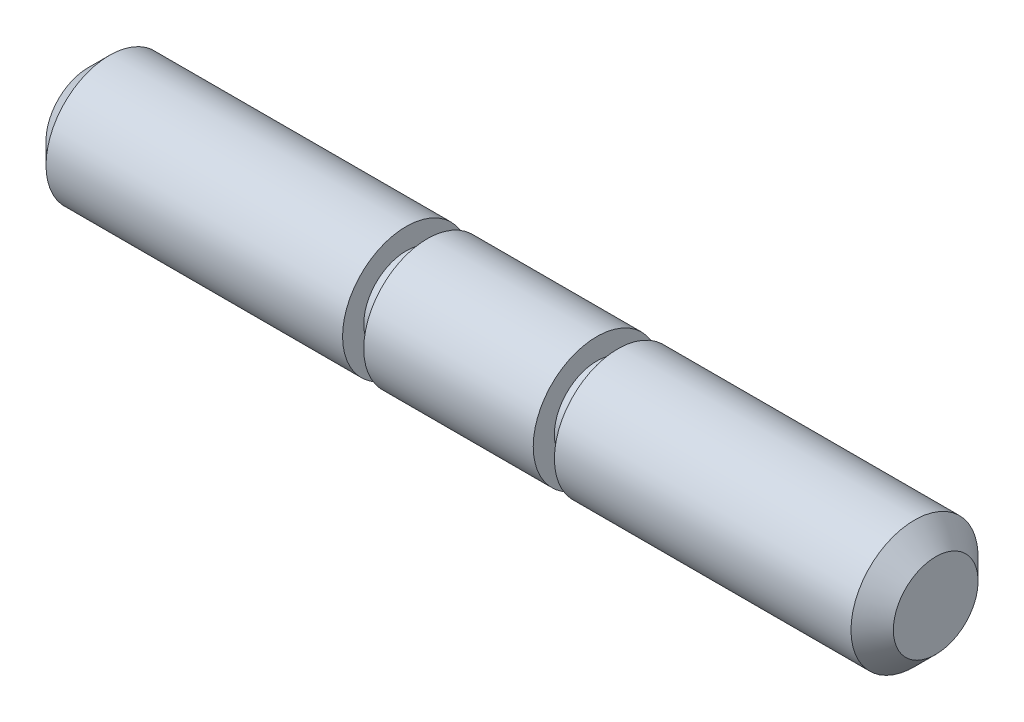
ISO-10303-21;
HEADER;
FILE_DESCRIPTION(('STEP AP214'),'2;1');
FILE_NAME('part.step','',(''),(''),'','','');
FILE_SCHEMA(('AUTOMOTIVE_DESIGN { 1 0 10303 214 1 1 1 1 }'));
ENDSEC;
DATA;
#1=APPLICATION_CONTEXT('core data for automotive mechanical design processes');
#2=APPLICATION_PROTOCOL_DEFINITION('international standard','automotive_design',2000,#1);
#3=PRODUCT_CONTEXT('',#1,'mechanical');
#4=PRODUCT('Part','Part','',(#3));
#5=PRODUCT_RELATED_PRODUCT_CATEGORY('part','',(#4));
#6=PRODUCT_DEFINITION_FORMATION('','',#4);
#7=PRODUCT_DEFINITION_CONTEXT('part definition',#1,'design');
#8=PRODUCT_DEFINITION('design','',#6,#7);
#9=PRODUCT_DEFINITION_SHAPE('','',#8);
#10=(LENGTH_UNIT() NAMED_UNIT(*) SI_UNIT(.MILLI.,.METRE.));
#11=(NAMED_UNIT(*) PLANE_ANGLE_UNIT() SI_UNIT($,.RADIAN.));
#12=(NAMED_UNIT(*) SI_UNIT($,.STERADIAN.) SOLID_ANGLE_UNIT());
#13=UNCERTAINTY_MEASURE_WITH_UNIT(LENGTH_MEASURE(1.E-05),#10,'distance_accuracy_value','');
#14=(GEOMETRIC_REPRESENTATION_CONTEXT(3) GLOBAL_UNCERTAINTY_ASSIGNED_CONTEXT((#13)) GLOBAL_UNIT_ASSIGNED_CONTEXT((#10,
#11,#12)) REPRESENTATION_CONTEXT('',''));
#15=CARTESIAN_POINT('',(0.,0.,0.));
#16=DIRECTION('',(0.,0.,1.));
#17=DIRECTION('',(1.,0.,0.));
#18=AXIS2_PLACEMENT_3D('',#15,#16,#17);
#19=CARTESIAN_POINT('',(-10.,1.5,0.));
#20=DIRECTION('',(1.,0.,0.));
#21=DIRECTION('',(0.,0.,-1.));
#22=AXIS2_PLACEMENT_3D('',#19,#20,#21);
#23=PLANE('',#22);
#24=CARTESIAN_POINT('',(-10.,0.,0.));
#25=DIRECTION('',(1.,0.,0.));
#26=DIRECTION('',(0.,0.,-1.));
#27=AXIS2_PLACEMENT_3D('',#24,#25,#26);
#28=CIRCLE('',#27,0.999999999999999);
#29=CARTESIAN_POINT('',(-10.,0.,-0.999999999999999));
#30=VERTEX_POINT('',#29);
#31=EDGE_CURVE('E36',#30,#30,#28,.F.);
#32=ORIENTED_EDGE('',*,*,#31,.T.);
#33=EDGE_LOOP('',(#32));
#34=FACE_BOUND('',#33,.T.);
#35=ADVANCED_FACE('F29',(#34),#23,.F.);
#36=CARTESIAN_POINT('',(10.,1.5,0.));
#37=DIRECTION('',(-1.,0.,0.));
#38=DIRECTION('',(0.,0.,1.));
#39=AXIS2_PLACEMENT_3D('',#36,#37,#38);
#40=PLANE('',#39);
#41=CARTESIAN_POINT('',(10.,0.,0.));
#42=DIRECTION('',(-1.,0.,0.));
#43=DIRECTION('',(0.,0.,1.));
#44=AXIS2_PLACEMENT_3D('',#41,#42,#43);
#45=CIRCLE('',#44,0.999999999999996);
#46=CARTESIAN_POINT('',(10.,0.,0.999999999999996));
#47=VERTEX_POINT('',#46);
#48=EDGE_CURVE('E40',#47,#47,#45,.F.);
#49=ORIENTED_EDGE('',*,*,#48,.T.);
#50=EDGE_LOOP('',(#49));
#51=FACE_BOUND('',#50,.T.);
#52=ADVANCED_FACE('F120',(#51),#40,.F.);
#53=CARTESIAN_POINT('',(0.,0.,0.));
#54=DIRECTION('',(-1.,0.,0.));
#55=DIRECTION('',(0.,0.,1.));
#56=AXIS2_PLACEMENT_3D('',#53,#54,#55);
#57=CYLINDRICAL_SURFACE('',#56,1.5);
#58=CARTESIAN_POINT('',(9.5,0.,0.));
#59=DIRECTION('',(-1.,0.,0.));
#60=DIRECTION('',(0.,0.,1.));
#61=AXIS2_PLACEMENT_3D('',#58,#59,#60);
#62=CIRCLE('',#61,1.5);
#63=CARTESIAN_POINT('',(9.5,0.,1.5));
#64=VERTEX_POINT('',#63);
#65=EDGE_CURVE('E44',#64,#64,#62,.T.);
#66=ORIENTED_EDGE('',*,*,#65,.T.);
#67=EDGE_LOOP('',(#66));
#68=FACE_BOUND('',#67,.T.);
#69=CARTESIAN_POINT('',(2.5,0.,0.));
#70=DIRECTION('',(-1.,0.,0.));
#71=DIRECTION('',(0.,0.,1.));
#72=AXIS2_PLACEMENT_3D('',#69,#70,#71);
#73=CIRCLE('',#72,1.5);
#74=CARTESIAN_POINT('',(2.5,0.,1.5));
#75=VERTEX_POINT('',#74);
#76=EDGE_CURVE('E49',#75,#75,#73,.T.);
#77=ORIENTED_EDGE('',*,*,#76,.F.);
#78=EDGE_LOOP('',(#77));
#79=FACE_BOUND('',#78,.T.);
#80=ADVANCED_FACE('F115',(#68,#79),#57,.T.);
#81=CARTESIAN_POINT('',(2.5,1.5,0.));
#82=DIRECTION('',(1.,0.,0.));
#83=DIRECTION('',(0.,0.,-1.));
#84=AXIS2_PLACEMENT_3D('',#81,#82,#83);
#85=PLANE('',#84);
#86=CARTESIAN_POINT('',(2.5,0.,0.));
#87=DIRECTION('',(-1.,0.,0.));
#88=DIRECTION('',(0.,0.,1.));
#89=AXIS2_PLACEMENT_3D('',#86,#87,#88);
#90=CIRCLE('',#89,1.);
#91=CARTESIAN_POINT('',(2.5,0.,1.));
#92=VERTEX_POINT('',#91);
#93=EDGE_CURVE('E52',#92,#92,#90,.T.);
#94=ORIENTED_EDGE('',*,*,#93,.F.);
#95=EDGE_LOOP('',(#94));
#96=FACE_BOUND('',#95,.T.);
#97=ORIENTED_EDGE('',*,*,#76,.T.);
#98=EDGE_LOOP('',(#97));
#99=FACE_BOUND('',#98,.T.);
#100=ADVANCED_FACE('F109',(#96,#99),#85,.F.);
#101=CARTESIAN_POINT('',(0.,0.,0.));
#102=DIRECTION('',(-1.,0.,0.));
#103=DIRECTION('',(0.,0.,1.));
#104=AXIS2_PLACEMENT_3D('',#101,#102,#103);
#105=CYLINDRICAL_SURFACE('',#104,1.);
#106=CARTESIAN_POINT('',(2.,0.,0.));
#107=DIRECTION('',(-1.,0.,0.));
#108=DIRECTION('',(0.,0.,1.));
#109=AXIS2_PLACEMENT_3D('',#106,#107,#108);
#110=CIRCLE('',#109,1.);
#111=CARTESIAN_POINT('',(2.,0.,1.));
#112=VERTEX_POINT('',#111);
#113=EDGE_CURVE('E55',#112,#112,#110,.T.);
#114=ORIENTED_EDGE('',*,*,#113,.F.);
#115=EDGE_LOOP('',(#114));
#116=FACE_BOUND('',#115,.T.);
#117=ORIENTED_EDGE('',*,*,#93,.T.);
#118=EDGE_LOOP('',(#117));
#119=FACE_BOUND('',#118,.T.);
#120=ADVANCED_FACE('F103',(#116,#119),#105,.T.);
#121=CARTESIAN_POINT('',(2.,1.5,0.));
#122=DIRECTION('',(-1.,0.,0.));
#123=DIRECTION('',(0.,0.,1.));
#124=AXIS2_PLACEMENT_3D('',#121,#122,#123);
#125=PLANE('',#124);
#126=CARTESIAN_POINT('',(2.,0.,0.));
#127=DIRECTION('',(-1.,0.,0.));
#128=DIRECTION('',(0.,0.,1.));
#129=AXIS2_PLACEMENT_3D('',#126,#127,#128);
#130=CIRCLE('',#129,1.5);
#131=CARTESIAN_POINT('',(2.,0.,1.5));
#132=VERTEX_POINT('',#131);
#133=EDGE_CURVE('E58',#132,#132,#130,.T.);
#134=ORIENTED_EDGE('',*,*,#133,.F.);
#135=EDGE_LOOP('',(#134));
#136=FACE_BOUND('',#135,.T.);
#137=ORIENTED_EDGE('',*,*,#113,.T.);
#138=EDGE_LOOP('',(#137));
#139=FACE_BOUND('',#138,.T.);
#140=ADVANCED_FACE('F97',(#136,#139),#125,.F.);
#141=CARTESIAN_POINT('',(0.,0.,0.));
#142=DIRECTION('',(-1.,0.,0.));
#143=DIRECTION('',(0.,0.,1.));
#144=AXIS2_PLACEMENT_3D('',#141,#142,#143);
#145=CYLINDRICAL_SURFACE('',#144,1.5);
#146=CARTESIAN_POINT('',(-2.,0.,0.));
#147=DIRECTION('',(-1.,0.,0.));
#148=DIRECTION('',(0.,0.,1.));
#149=AXIS2_PLACEMENT_3D('',#146,#147,#148);
#150=CIRCLE('',#149,1.5);
#151=CARTESIAN_POINT('',(-2.,0.,1.5));
#152=VERTEX_POINT('',#151);
#153=EDGE_CURVE('E61',#152,#152,#150,.T.);
#154=ORIENTED_EDGE('',*,*,#153,.F.);
#155=EDGE_LOOP('',(#154));
#156=FACE_BOUND('',#155,.T.);
#157=ORIENTED_EDGE('',*,*,#133,.T.);
#158=EDGE_LOOP('',(#157));
#159=FACE_BOUND('',#158,.T.);
#160=ADVANCED_FACE('F91',(#156,#159),#145,.T.);
#161=CARTESIAN_POINT('',(-2.,1.5,0.));
#162=DIRECTION('',(1.,0.,0.));
#163=DIRECTION('',(0.,0.,-1.));
#164=AXIS2_PLACEMENT_3D('',#161,#162,#163);
#165=PLANE('',#164);
#166=CARTESIAN_POINT('',(-2.,0.,0.));
#167=DIRECTION('',(-1.,0.,0.));
#168=DIRECTION('',(0.,0.,1.));
#169=AXIS2_PLACEMENT_3D('',#166,#167,#168);
#170=CIRCLE('',#169,1.);
#171=CARTESIAN_POINT('',(-2.,0.,1.));
#172=VERTEX_POINT('',#171);
#173=EDGE_CURVE('E64',#172,#172,#170,.T.);
#174=ORIENTED_EDGE('',*,*,#173,.F.);
#175=EDGE_LOOP('',(#174));
#176=FACE_BOUND('',#175,.T.);
#177=ORIENTED_EDGE('',*,*,#153,.T.);
#178=EDGE_LOOP('',(#177));
#179=FACE_BOUND('',#178,.T.);
#180=ADVANCED_FACE('F85',(#176,#179),#165,.F.);
#181=CARTESIAN_POINT('',(0.,0.,0.));
#182=DIRECTION('',(-1.,0.,0.));
#183=DIRECTION('',(0.,0.,1.));
#184=AXIS2_PLACEMENT_3D('',#181,#182,#183);
#185=CYLINDRICAL_SURFACE('',#184,1.);
#186=CARTESIAN_POINT('',(-2.5,0.,0.));
#187=DIRECTION('',(-1.,0.,0.));
#188=DIRECTION('',(0.,0.,1.));
#189=AXIS2_PLACEMENT_3D('',#186,#187,#188);
#190=CIRCLE('',#189,1.);
#191=CARTESIAN_POINT('',(-2.5,0.,1.));
#192=VERTEX_POINT('',#191);
#193=EDGE_CURVE('E67',#192,#192,#190,.T.);
#194=ORIENTED_EDGE('',*,*,#193,.F.);
#195=EDGE_LOOP('',(#194));
#196=FACE_BOUND('',#195,.T.);
#197=ORIENTED_EDGE('',*,*,#173,.T.);
#198=EDGE_LOOP('',(#197));
#199=FACE_BOUND('',#198,.T.);
#200=ADVANCED_FACE('F79',(#196,#199),#185,.T.);
#201=CARTESIAN_POINT('',(-2.5,1.5,0.));
#202=DIRECTION('',(-1.,0.,0.));
#203=DIRECTION('',(0.,0.,1.));
#204=AXIS2_PLACEMENT_3D('',#201,#202,#203);
#205=PLANE('',#204);
#206=CARTESIAN_POINT('',(-2.5,0.,0.));
#207=DIRECTION('',(-1.,0.,0.));
#208=DIRECTION('',(0.,0.,1.));
#209=AXIS2_PLACEMENT_3D('',#206,#207,#208);
#210=CIRCLE('',#209,1.5);
#211=CARTESIAN_POINT('',(-2.5,0.,1.5));
#212=VERTEX_POINT('',#211);
#213=EDGE_CURVE('E70',#212,#212,#210,.T.);
#214=ORIENTED_EDGE('',*,*,#213,.F.);
#215=EDGE_LOOP('',(#214));
#216=FACE_BOUND('',#215,.T.);
#217=ORIENTED_EDGE('',*,*,#193,.T.);
#218=EDGE_LOOP('',(#217));
#219=FACE_BOUND('',#218,.T.);
#220=ADVANCED_FACE('F76',(#216,#219),#205,.F.);
#221=CARTESIAN_POINT('',(0.,0.,0.));
#222=DIRECTION('',(-1.,0.,0.));
#223=DIRECTION('',(0.,0.,1.));
#224=AXIS2_PLACEMENT_3D('',#221,#222,#223);
#225=CYLINDRICAL_SURFACE('',#224,1.5);
#226=CARTESIAN_POINT('',(-9.5,0.,0.));
#227=DIRECTION('',(1.,0.,0.));
#228=DIRECTION('',(0.,0.,-1.));
#229=AXIS2_PLACEMENT_3D('',#226,#227,#228);
#230=CIRCLE('',#229,1.5);
#231=CARTESIAN_POINT('',(-9.5,0.,-1.5));
#232=VERTEX_POINT('',#231);
#233=EDGE_CURVE('E10',#232,#232,#230,.T.);
#234=ORIENTED_EDGE('',*,*,#233,.T.);
#235=EDGE_LOOP('',(#234));
#236=FACE_BOUND('',#235,.T.);
#237=ORIENTED_EDGE('',*,*,#213,.T.);
#238=EDGE_LOOP('',(#237));
#239=FACE_BOUND('',#238,.T.);
#240=ADVANCED_FACE('F74',(#236,#239),#225,.T.);
#241=CARTESIAN_POINT('',(9.5,0.,0.));
#242=DIRECTION('',(-1.,0.,0.));
#243=DIRECTION('',(0.,0.,1.));
#244=AXIS2_PLACEMENT_3D('',#241,#242,#243);
#245=CONICAL_SURFACE('',#244,1.5,0.78539816339745);
#246=ORIENTED_EDGE('',*,*,#48,.F.);
#247=EDGE_LOOP('',(#246));
#248=FACE_BOUND('',#247,.T.);
#249=ORIENTED_EDGE('',*,*,#65,.F.);
#250=EDGE_LOOP('',(#249));
#251=FACE_BOUND('',#250,.T.);
#252=ADVANCED_FACE('F132',(#248,#251),#245,.T.);
#253=CARTESIAN_POINT('',(-10.,0.,0.));
#254=DIRECTION('',(1.,0.,0.));
#255=DIRECTION('',(0.,0.,-1.));
#256=AXIS2_PLACEMENT_3D('',#253,#254,#255);
#257=CONICAL_SURFACE('',#256,0.999999999999999,0.785398163397447);
#258=ORIENTED_EDGE('',*,*,#233,.F.);
#259=EDGE_LOOP('',(#258));
#260=FACE_BOUND('',#259,.T.);
#261=ORIENTED_EDGE('',*,*,#31,.F.);
#262=EDGE_LOOP('',(#261));
#263=FACE_BOUND('',#262,.T.);
#264=ADVANCED_FACE('F31',(#260,#263),#257,.T.);
#265=CLOSED_SHELL('',(#35,#52,#80,#100,#120,#140,#160,#180,#200,#220,#240,#252,#264));
#266=MANIFOLD_SOLID_BREP('B2',#265);
#267=ADVANCED_BREP_SHAPE_REPRESENTATION('',(#18,#266),#14);
#268=SHAPE_DEFINITION_REPRESENTATION(#9,#267);
ENDSEC;
END-ISO-10303-21;
